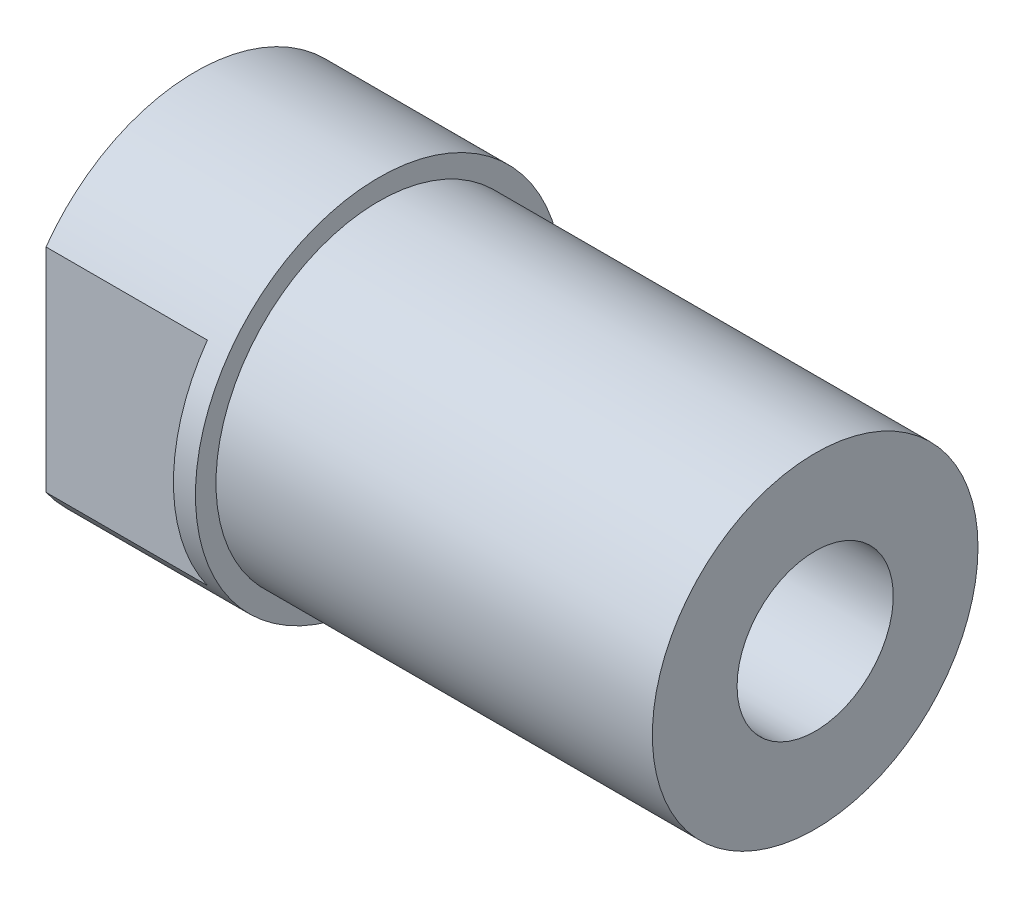
ISO-10303-21;
HEADER;
FILE_DESCRIPTION(('STEP AP214'),'2;1');
FILE_NAME('part.step','',(''),(''),'','','');
FILE_SCHEMA(('AUTOMOTIVE_DESIGN { 1 0 10303 214 1 1 1 1 }'));
ENDSEC;
DATA;
#1=APPLICATION_CONTEXT('core data for automotive mechanical design processes');
#2=APPLICATION_PROTOCOL_DEFINITION('international standard','automotive_design',2000,#1);
#3=PRODUCT_CONTEXT('',#1,'mechanical');
#4=PRODUCT('Part','Part','',(#3));
#5=PRODUCT_RELATED_PRODUCT_CATEGORY('part','',(#4));
#6=PRODUCT_DEFINITION_FORMATION('','',#4);
#7=PRODUCT_DEFINITION_CONTEXT('part definition',#1,'design');
#8=PRODUCT_DEFINITION('design','',#6,#7);
#9=PRODUCT_DEFINITION_SHAPE('','',#8);
#10=(LENGTH_UNIT() NAMED_UNIT(*) SI_UNIT(.MILLI.,.METRE.));
#11=(NAMED_UNIT(*) PLANE_ANGLE_UNIT() SI_UNIT($,.RADIAN.));
#12=(NAMED_UNIT(*) SI_UNIT($,.STERADIAN.) SOLID_ANGLE_UNIT());
#13=UNCERTAINTY_MEASURE_WITH_UNIT(LENGTH_MEASURE(1.E-05),#10,'distance_accuracy_value','');
#14=(GEOMETRIC_REPRESENTATION_CONTEXT(3) GLOBAL_UNCERTAINTY_ASSIGNED_CONTEXT((#13)) GLOBAL_UNIT_ASSIGNED_CONTEXT((#10,
#11,#12)) REPRESENTATION_CONTEXT('',''));
#15=CARTESIAN_POINT('',(0.,0.,0.));
#16=DIRECTION('',(0.,0.,1.));
#17=DIRECTION('',(1.,0.,0.));
#18=AXIS2_PLACEMENT_3D('',#15,#16,#17);
#19=CARTESIAN_POINT('',(-6.35,0.,0.));
#20=DIRECTION('',(1.,0.,0.));
#21=DIRECTION('',(0.,0.,-1.));
#22=AXIS2_PLACEMENT_3D('',#19,#20,#21);
#23=CYLINDRICAL_SURFACE('',#22,6.35);
#24=DIRECTION('',(1.,0.,0.));
#25=VECTOR('',#24,1.);
#26=CARTESIAN_POINT('',(-6.35,-3.67957707318382,-5.17525));
#27=LINE('',#26,#25);
#28=CARTESIAN_POINT('',(-0.762,-3.67957707318382,-5.17525));
#29=VERTEX_POINT('',#28);
#30=CARTESIAN_POINT('',(-6.35,-3.67957707318382,-5.17525));
#31=VERTEX_POINT('',#30);
#32=EDGE_CURVE('E57',#29,#31,#27,.F.);
#33=ORIENTED_EDGE('',*,*,#32,.F.);
#34=CARTESIAN_POINT('',(-0.762,0.,0.));
#35=DIRECTION('',(1.,0.,0.));
#36=DIRECTION('',(0.,0.,-1.));
#37=AXIS2_PLACEMENT_3D('',#34,#35,#36);
#38=CIRCLE('',#37,6.35);
#39=CARTESIAN_POINT('',(-0.762,3.67957707318382,-5.17525));
#40=VERTEX_POINT('',#39);
#41=EDGE_CURVE('E11',#40,#29,#38,.F.);
#42=ORIENTED_EDGE('',*,*,#41,.F.);
#43=DIRECTION('',(1.,0.,0.));
#44=VECTOR('',#43,1.);
#45=CARTESIAN_POINT('',(-6.35,3.67957707318382,-5.17525));
#46=LINE('',#45,#44);
#47=CARTESIAN_POINT('',(-6.35,3.67957707318382,-5.17525));
#48=VERTEX_POINT('',#47);
#49=EDGE_CURVE('E114',#48,#40,#46,.T.);
#50=ORIENTED_EDGE('',*,*,#49,.F.);
#51=CARTESIAN_POINT('',(-6.35,0.,0.));
#52=DIRECTION('',(1.,0.,0.));
#53=DIRECTION('',(0.,0.,-1.));
#54=AXIS2_PLACEMENT_3D('',#51,#52,#53);
#55=CIRCLE('',#54,6.35);
#56=CARTESIAN_POINT('',(-6.35,3.67957707318382,5.17525));
#57=VERTEX_POINT('',#56);
#58=EDGE_CURVE('E128',#48,#57,#55,.T.);
#59=ORIENTED_EDGE('',*,*,#58,.T.);
#60=DIRECTION('',(1.,0.,0.));
#61=VECTOR('',#60,1.);
#62=CARTESIAN_POINT('',(-6.35,3.67957707318382,5.17525));
#63=LINE('',#62,#61);
#64=CARTESIAN_POINT('',(-0.762,3.67957707318382,5.17525));
#65=VERTEX_POINT('',#64);
#66=EDGE_CURVE('E65',#65,#57,#63,.F.);
#67=ORIENTED_EDGE('',*,*,#66,.F.);
#68=CARTESIAN_POINT('',(-0.762,0.,0.));
#69=DIRECTION('',(1.,0.,0.));
#70=DIRECTION('',(0.,0.,-1.));
#71=AXIS2_PLACEMENT_3D('',#68,#69,#70);
#72=CIRCLE('',#71,6.35);
#73=CARTESIAN_POINT('',(-0.762,-3.67957707318382,5.17525));
#74=VERTEX_POINT('',#73);
#75=EDGE_CURVE('E50',#74,#65,#72,.F.);
#76=ORIENTED_EDGE('',*,*,#75,.F.);
#77=DIRECTION('',(1.,0.,0.));
#78=VECTOR('',#77,1.);
#79=CARTESIAN_POINT('',(-6.35,-3.67957707318382,5.17525));
#80=LINE('',#79,#78);
#81=CARTESIAN_POINT('',(-6.35,-3.67957707318382,5.17525));
#82=VERTEX_POINT('',#81);
#83=EDGE_CURVE('E86',#82,#74,#80,.T.);
#84=ORIENTED_EDGE('',*,*,#83,.F.);
#85=EDGE_CURVE('E129',#82,#31,#55,.T.);
#86=ORIENTED_EDGE('',*,*,#85,.T.);
#87=EDGE_LOOP('',(#33,#42,#50,#59,#67,#76,#84,#86));
#88=FACE_BOUND('',#87,.T.);
#89=CARTESIAN_POINT('',(0.,0.,0.));
#90=DIRECTION('',(1.,0.,0.));
#91=DIRECTION('',(0.,0.,-1.));
#92=AXIS2_PLACEMENT_3D('',#89,#90,#91);
#93=CIRCLE('',#92,6.35);
#94=CARTESIAN_POINT('',(0.,0.,-6.35));
#95=VERTEX_POINT('',#94);
#96=EDGE_CURVE('E123',#95,#95,#93,.T.);
#97=ORIENTED_EDGE('',*,*,#96,.F.);
#98=EDGE_LOOP('',(#97));
#99=FACE_BOUND('',#98,.T.);
#100=ADVANCED_FACE('F42',(#88,#99),#23,.T.);
#101=CARTESIAN_POINT('',(-6.35,0.,0.));
#102=DIRECTION('',(1.,0.,0.));
#103=DIRECTION('',(0.,0.,-1.));
#104=AXIS2_PLACEMENT_3D('',#101,#102,#103);
#105=PLANE('',#104);
#106=CARTESIAN_POINT('',(-6.35,0.,0.));
#107=DIRECTION('',(-1.,0.,0.));
#108=DIRECTION('',(0.,0.,1.));
#109=AXIS2_PLACEMENT_3D('',#106,#107,#108);
#110=CIRCLE('',#109,2.7051);
#111=CARTESIAN_POINT('',(-6.35,0.,2.7051));
#112=VERTEX_POINT('',#111);
#113=EDGE_CURVE('E109',#112,#112,#110,.T.);
#114=ORIENTED_EDGE('',*,*,#113,.F.);
#115=EDGE_LOOP('',(#114));
#116=FACE_BOUND('',#115,.T.);
#117=ORIENTED_EDGE('',*,*,#58,.F.);
#118=DIRECTION('',(0.,-1.,0.));
#119=VECTOR('',#118,1.);
#120=CARTESIAN_POINT('',(-6.35,0.,-5.17525));
#121=LINE('',#120,#119);
#122=EDGE_CURVE('E92',#48,#31,#121,.T.);
#123=ORIENTED_EDGE('',*,*,#122,.T.);
#124=ORIENTED_EDGE('',*,*,#85,.F.);
#125=DIRECTION('',(0.,1.,0.));
#126=VECTOR('',#125,1.);
#127=CARTESIAN_POINT('',(-6.35,0.,5.17525));
#128=LINE('',#127,#126);
#129=EDGE_CURVE('E95',#82,#57,#128,.T.);
#130=ORIENTED_EDGE('',*,*,#129,.T.);
#131=EDGE_LOOP('',(#117,#123,#124,#130));
#132=FACE_BOUND('',#131,.T.);
#133=ADVANCED_FACE('F141',(#116,#132),#105,.F.);
#134=CARTESIAN_POINT('',(0.,0.,0.));
#135=DIRECTION('',(1.,0.,0.));
#136=DIRECTION('',(0.,0.,-1.));
#137=AXIS2_PLACEMENT_3D('',#134,#135,#136);
#138=PLANE('',#137);
#139=CARTESIAN_POINT('',(0.,0.,0.));
#140=DIRECTION('',(1.,0.,0.));
#141=DIRECTION('',(0.,0.,-1.));
#142=AXIS2_PLACEMENT_3D('',#139,#140,#141);
#143=CIRCLE('',#142,5.6388);
#144=CARTESIAN_POINT('',(0.,0.,-5.6388));
#145=VERTEX_POINT('',#144);
#146=EDGE_CURVE('E124',#145,#145,#143,.T.);
#147=ORIENTED_EDGE('',*,*,#146,.F.);
#148=EDGE_LOOP('',(#147));
#149=FACE_BOUND('',#148,.T.);
#150=ORIENTED_EDGE('',*,*,#96,.T.);
#151=EDGE_LOOP('',(#150));
#152=FACE_BOUND('',#151,.T.);
#153=ADVANCED_FACE('F162',(#149,#152),#138,.T.);
#154=CARTESIAN_POINT('',(15.113,0.,0.));
#155=DIRECTION('',(-1.,0.,0.));
#156=DIRECTION('',(0.,0.,1.));
#157=AXIS2_PLACEMENT_3D('',#154,#155,#156);
#158=CYLINDRICAL_SURFACE('',#157,5.6388);
#159=CARTESIAN_POINT('',(15.113,0.,0.));
#160=DIRECTION('',(1.,0.,0.));
#161=DIRECTION('',(0.,0.,-1.));
#162=AXIS2_PLACEMENT_3D('',#159,#160,#161);
#163=CIRCLE('',#162,5.6388);
#164=CARTESIAN_POINT('',(15.113,0.,-5.6388));
#165=VERTEX_POINT('',#164);
#166=EDGE_CURVE('E119',#165,#165,#163,.T.);
#167=ORIENTED_EDGE('',*,*,#166,.F.);
#168=EDGE_LOOP('',(#167));
#169=FACE_BOUND('',#168,.T.);
#170=ORIENTED_EDGE('',*,*,#146,.T.);
#171=EDGE_LOOP('',(#170));
#172=FACE_BOUND('',#171,.T.);
#173=ADVANCED_FACE('F168',(#169,#172),#158,.T.);
#174=CARTESIAN_POINT('',(15.113,0.,0.));
#175=DIRECTION('',(1.,0.,0.));
#176=DIRECTION('',(0.,0.,-1.));
#177=AXIS2_PLACEMENT_3D('',#174,#175,#176);
#178=PLANE('',#177);
#179=CARTESIAN_POINT('',(15.113,0.,0.));
#180=DIRECTION('',(-1.,0.,0.));
#181=DIRECTION('',(0.,0.,1.));
#182=AXIS2_PLACEMENT_3D('',#179,#180,#181);
#183=CIRCLE('',#182,2.70509999999999);
#184=CARTESIAN_POINT('',(15.113,0.,2.70509999999999));
#185=VERTEX_POINT('',#184);
#186=EDGE_CURVE('E101',#185,#185,#183,.T.);
#187=ORIENTED_EDGE('',*,*,#186,.T.);
#188=EDGE_LOOP('',(#187));
#189=FACE_BOUND('',#188,.T.);
#190=ORIENTED_EDGE('',*,*,#166,.T.);
#191=EDGE_LOOP('',(#190));
#192=FACE_BOUND('',#191,.T.);
#193=ADVANCED_FACE('F174',(#189,#192),#178,.T.);
#194=CARTESIAN_POINT('',(-6.35,-6.35,5.17525));
#195=DIRECTION('',(0.,0.,-1.));
#196=DIRECTION('',(-1.,0.,0.));
#197=AXIS2_PLACEMENT_3D('',#194,#195,#196);
#198=PLANE('',#197);
#199=ORIENTED_EDGE('',*,*,#66,.T.);
#200=ORIENTED_EDGE('',*,*,#129,.F.);
#201=ORIENTED_EDGE('',*,*,#83,.T.);
#202=DIRECTION('',(0.,1.,0.));
#203=VECTOR('',#202,1.);
#204=CARTESIAN_POINT('',(-0.762,-6.35,5.17525));
#205=LINE('',#204,#203);
#206=EDGE_CURVE('E94',#74,#65,#205,.T.);
#207=ORIENTED_EDGE('',*,*,#206,.T.);
#208=EDGE_LOOP('',(#199,#200,#201,#207));
#209=FACE_BOUND('',#208,.T.);
#210=ADVANCED_FACE('F93',(#209),#198,.F.);
#211=CARTESIAN_POINT('',(-0.762,-6.35,6.35));
#212=DIRECTION('',(1.,0.,0.));
#213=DIRECTION('',(0.,0.,-1.));
#214=AXIS2_PLACEMENT_3D('',#211,#212,#213);
#215=PLANE('',#214);
#216=ORIENTED_EDGE('',*,*,#206,.F.);
#217=ORIENTED_EDGE('',*,*,#75,.T.);
#218=EDGE_LOOP('',(#216,#217));
#219=FACE_BOUND('',#218,.T.);
#220=ADVANCED_FACE('F99',(#219),#215,.F.);
#221=CARTESIAN_POINT('',(-0.762,-6.35,-6.35));
#222=DIRECTION('',(1.,0.,0.));
#223=DIRECTION('',(0.,0.,-1.));
#224=AXIS2_PLACEMENT_3D('',#221,#222,#223);
#225=PLANE('',#224);
#226=ORIENTED_EDGE('',*,*,#41,.T.);
#227=DIRECTION('',(0.,1.,0.));
#228=VECTOR('',#227,1.);
#229=CARTESIAN_POINT('',(-0.762,-6.35,-5.17525));
#230=LINE('',#229,#228);
#231=EDGE_CURVE('E97',#29,#40,#230,.T.);
#232=ORIENTED_EDGE('',*,*,#231,.T.);
#233=EDGE_LOOP('',(#226,#232));
#234=FACE_BOUND('',#233,.T.);
#235=ADVANCED_FACE('F145',(#234),#225,.F.);
#236=CARTESIAN_POINT('',(-6.35,-6.35,-5.17525));
#237=DIRECTION('',(0.,0.,1.));
#238=DIRECTION('',(1.,0.,0.));
#239=AXIS2_PLACEMENT_3D('',#236,#237,#238);
#240=PLANE('',#239);
#241=ORIENTED_EDGE('',*,*,#32,.T.);
#242=ORIENTED_EDGE('',*,*,#122,.F.);
#243=ORIENTED_EDGE('',*,*,#49,.T.);
#244=ORIENTED_EDGE('',*,*,#231,.F.);
#245=EDGE_LOOP('',(#241,#242,#243,#244));
#246=FACE_BOUND('',#245,.T.);
#247=ADVANCED_FACE('F146',(#246),#240,.F.);
#248=CARTESIAN_POINT('',(-6.35,0.,0.));
#249=DIRECTION('',(-1.,0.,0.));
#250=DIRECTION('',(0.,0.,1.));
#251=AXIS2_PLACEMENT_3D('',#248,#249,#250);
#252=CYLINDRICAL_SURFACE('',#251,2.7051);
#253=ORIENTED_EDGE('',*,*,#186,.F.);
#254=EDGE_LOOP('',(#253));
#255=FACE_BOUND('',#254,.T.);
#256=ORIENTED_EDGE('',*,*,#113,.T.);
#257=EDGE_LOOP('',(#256));
#258=FACE_BOUND('',#257,.T.);
#259=ADVANCED_FACE('F148',(#255,#258),#252,.F.);
#260=CLOSED_SHELL('',(#100,#133,#153,#173,#193,#210,#220,#235,#247,#259));
#261=MANIFOLD_SOLID_BREP('B2',#260);
#262=ADVANCED_BREP_SHAPE_REPRESENTATION('',(#18,#261),#14);
#263=SHAPE_DEFINITION_REPRESENTATION(#9,#262);
ENDSEC;
END-ISO-10303-21;
